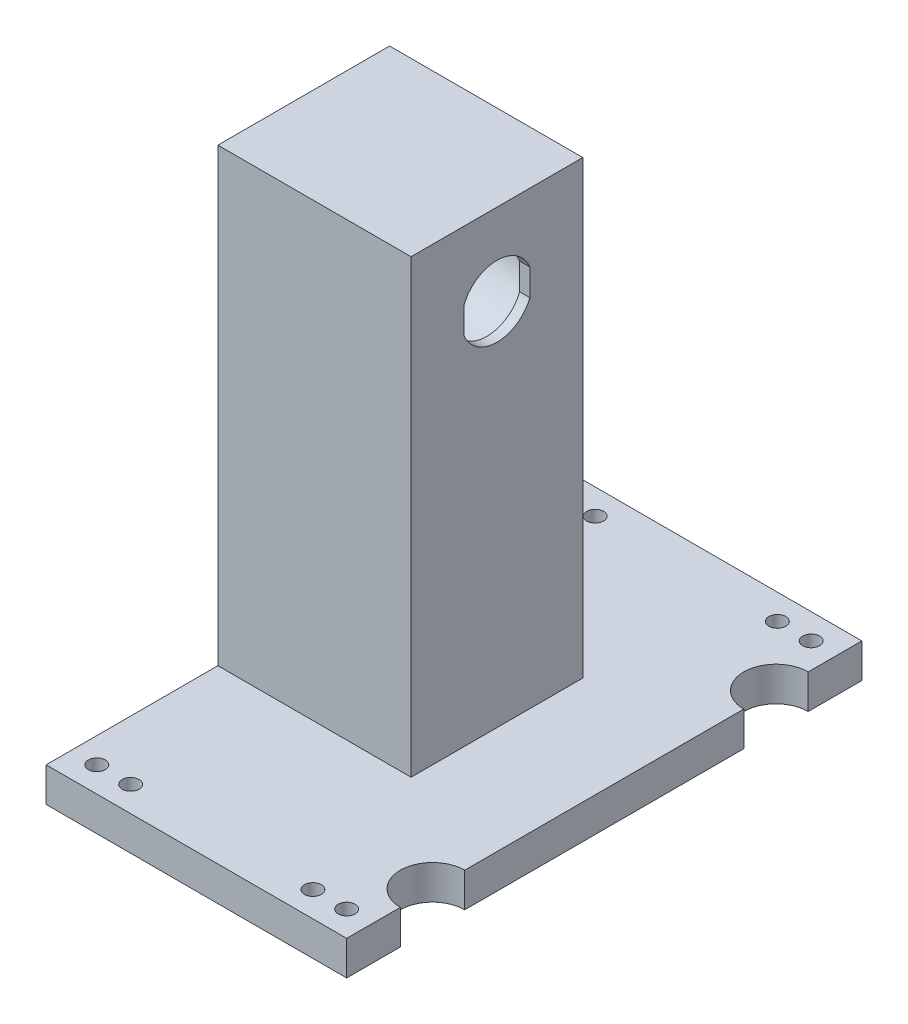
ISO-10303-21;
HEADER;
FILE_DESCRIPTION(('STEP AP214'),'2;1');
FILE_NAME('part.step','',(''),(''),'','','');
FILE_SCHEMA(('AUTOMOTIVE_DESIGN { 1 0 10303 214 1 1 1 1 }'));
ENDSEC;
DATA;
#1=APPLICATION_CONTEXT('core data for automotive mechanical design processes');
#2=APPLICATION_PROTOCOL_DEFINITION('international standard','automotive_design',2000,#1);
#3=PRODUCT_CONTEXT('',#1,'mechanical');
#4=PRODUCT('Part','Part','',(#3));
#5=PRODUCT_RELATED_PRODUCT_CATEGORY('part','',(#4));
#6=PRODUCT_DEFINITION_FORMATION('','',#4);
#7=PRODUCT_DEFINITION_CONTEXT('part definition',#1,'design');
#8=PRODUCT_DEFINITION('design','',#6,#7);
#9=PRODUCT_DEFINITION_SHAPE('','',#8);
#10=(LENGTH_UNIT() NAMED_UNIT(*) SI_UNIT(.MILLI.,.METRE.));
#11=(NAMED_UNIT(*) PLANE_ANGLE_UNIT() SI_UNIT($,.RADIAN.));
#12=(NAMED_UNIT(*) SI_UNIT($,.STERADIAN.) SOLID_ANGLE_UNIT());
#13=UNCERTAINTY_MEASURE_WITH_UNIT(LENGTH_MEASURE(1.E-05),#10,'distance_accuracy_value','');
#14=(GEOMETRIC_REPRESENTATION_CONTEXT(3) GLOBAL_UNCERTAINTY_ASSIGNED_CONTEXT((#13)) GLOBAL_UNIT_ASSIGNED_CONTEXT((#10,
#11,#12)) REPRESENTATION_CONTEXT('',''));
#15=CARTESIAN_POINT('',(0.,0.,0.));
#16=DIRECTION('',(0.,0.,1.));
#17=DIRECTION('',(1.,0.,0.));
#18=AXIS2_PLACEMENT_3D('',#15,#16,#17);
#19=CARTESIAN_POINT('',(53.34,10.16,-56.5855555555556));
#20=DIRECTION('',(-1.,0.,0.));
#21=DIRECTION('',(0.,0.,1.));
#22=AXIS2_PLACEMENT_3D('',#19,#20,#21);
#23=PLANE('',#22);
#24=DIRECTION('',(0.,0.,-1.));
#25=VECTOR('',#24,1.);
#26=CARTESIAN_POINT('',(53.34,0.,-56.5855555555556));
#27=LINE('',#26,#25);
#28=CARTESIAN_POINT('',(53.34,0.,95.8144444444444));
#29=VERTEX_POINT('',#28);
#30=CARTESIAN_POINT('',(53.34,0.,79.9394444444444));
#31=VERTEX_POINT('',#30);
#32=EDGE_CURVE('E183',#29,#31,#27,.T.);
#33=ORIENTED_EDGE('',*,*,#32,.T.);
#34=DIRECTION('',(0.,1.,0.));
#35=VECTOR('',#34,1.);
#36=CARTESIAN_POINT('',(53.34,-2.54,79.9394444444444));
#37=LINE('',#36,#35);
#38=CARTESIAN_POINT('',(53.34,10.16,79.9394444444444));
#39=VERTEX_POINT('',#38);
#40=EDGE_CURVE('E56',#31,#39,#37,.T.);
#41=ORIENTED_EDGE('',*,*,#40,.T.);
#42=DIRECTION('',(0.,0.,-1.));
#43=VECTOR('',#42,1.);
#44=CARTESIAN_POINT('',(53.34,10.16,-56.5855555555556));
#45=LINE('',#44,#43);
#46=CARTESIAN_POINT('',(53.34,10.16,95.8144444444444));
#47=VERTEX_POINT('',#46);
#48=EDGE_CURVE('E166',#47,#39,#45,.T.);
#49=ORIENTED_EDGE('',*,*,#48,.F.);
#50=DIRECTION('',(0.,-1.,0.));
#51=VECTOR('',#50,1.);
#52=CARTESIAN_POINT('',(53.34,10.16,95.8144444444444));
#53=LINE('',#52,#51);
#54=EDGE_CURVE('E194',#47,#29,#53,.T.);
#55=ORIENTED_EDGE('',*,*,#54,.T.);
#56=EDGE_LOOP('',(#33,#41,#49,#55));
#57=FACE_BOUND('',#56,.T.);
#58=ADVANCED_FACE('F33',(#57),#23,.F.);
#59=CARTESIAN_POINT('',(53.34,10.16,60.8894444444444));
#60=VERTEX_POINT('',#59);
#61=CARTESIAN_POINT('',(53.34,10.16,-21.6605555555556));
#62=VERTEX_POINT('',#61);
#63=EDGE_CURVE('E157',#60,#62,#45,.T.);
#64=ORIENTED_EDGE('',*,*,#63,.F.);
#65=DIRECTION('',(0.,1.,0.));
#66=VECTOR('',#65,1.);
#67=CARTESIAN_POINT('',(53.34,-2.54,60.8894444444444));
#68=LINE('',#67,#66);
#69=CARTESIAN_POINT('',(53.34,0.,60.8894444444444));
#70=VERTEX_POINT('',#69);
#71=EDGE_CURVE('E160',#60,#70,#68,.F.);
#72=ORIENTED_EDGE('',*,*,#71,.T.);
#73=CARTESIAN_POINT('',(53.34,0.,-21.6605555555556));
#74=VERTEX_POINT('',#73);
#75=EDGE_CURVE('E159',#70,#74,#27,.T.);
#76=ORIENTED_EDGE('',*,*,#75,.T.);
#77=DIRECTION('',(0.,1.,0.));
#78=VECTOR('',#77,1.);
#79=CARTESIAN_POINT('',(53.34,-2.54,-21.6605555555556));
#80=LINE('',#79,#78);
#81=EDGE_CURVE('E48',#74,#62,#80,.T.);
#82=ORIENTED_EDGE('',*,*,#81,.T.);
#83=EDGE_LOOP('',(#64,#72,#76,#82));
#84=FACE_BOUND('',#83,.T.);
#85=ADVANCED_FACE('F155',(#84),#23,.F.);
#86=CARTESIAN_POINT('',(-35.56,119.38,19.6144444444444));
#87=DIRECTION('',(1.,0.,0.));
#88=DIRECTION('',(0.,0.,-1.));
#89=AXIS2_PLACEMENT_3D('',#86,#87,#88);
#90=CYLINDRICAL_SURFACE('',#89,10.5);
#91=CARTESIAN_POINT('',(21.59,119.38,19.6144444444444));
#92=DIRECTION('',(1.,0.,0.));
#93=DIRECTION('',(0.,0.,-1.));
#94=AXIS2_PLACEMENT_3D('',#91,#92,#93);
#95=CIRCLE('',#94,10.5);
#96=CARTESIAN_POINT('',(21.59,115.443,29.3484072037732));
#97=VERTEX_POINT('',#96);
#98=CARTESIAN_POINT('',(21.59,115.443,9.88048168511562));
#99=VERTEX_POINT('',#98);
#100=EDGE_CURVE('E250',#97,#99,#95,.T.);
#101=ORIENTED_EDGE('',*,*,#100,.T.);
#102=DIRECTION('',(1.,0.,0.));
#103=VECTOR('',#102,1.);
#104=CARTESIAN_POINT('',(10.6788250522381,115.443,9.88048168511562));
#105=LINE('',#104,#103);
#106=CARTESIAN_POINT('',(18.59,115.443,9.88048168511562));
#107=VERTEX_POINT('',#106);
#108=EDGE_CURVE('E226',#107,#99,#105,.T.);
#109=ORIENTED_EDGE('',*,*,#108,.F.);
#110=CARTESIAN_POINT('',(18.59,119.38,19.6144444444444));
#111=DIRECTION('',(-1.,0.,0.));
#112=DIRECTION('',(0.,0.,1.));
#113=AXIS2_PLACEMENT_3D('',#110,#111,#112);
#114=CIRCLE('',#113,10.5);
#115=CARTESIAN_POINT('',(18.59,115.443,29.3484072037732));
#116=VERTEX_POINT('',#115);
#117=EDGE_CURVE('E200',#116,#107,#114,.F.);
#118=ORIENTED_EDGE('',*,*,#117,.F.);
#119=DIRECTION('',(1.,0.,0.));
#120=VECTOR('',#119,1.);
#121=CARTESIAN_POINT('',(10.6788250522381,115.443,29.3484072037732));
#122=LINE('',#121,#120);
#123=EDGE_CURVE('E240',#116,#97,#122,.T.);
#124=ORIENTED_EDGE('',*,*,#123,.T.);
#125=EDGE_LOOP('',(#101,#109,#118,#124));
#126=FACE_BOUND('',#125,.T.);
#127=ADVANCED_FACE('F349',(#126),#90,.F.);
#128=CARTESIAN_POINT('',(18.59,119.38,19.6144444444444));
#129=DIRECTION('',(-1.,0.,0.));
#130=DIRECTION('',(0.,0.,1.));
#131=AXIS2_PLACEMENT_3D('',#128,#129,#130);
#132=CYLINDRICAL_SURFACE('',#131,16.5);
#133=CARTESIAN_POINT('',(18.59,119.38,19.6144444444444));
#134=DIRECTION('',(-1.,0.,0.));
#135=DIRECTION('',(0.,0.,1.));
#136=AXIS2_PLACEMENT_3D('',#133,#134,#135);
#137=CIRCLE('',#136,16.5);
#138=CARTESIAN_POINT('',(18.59,119.38,36.1144444444444));
#139=VERTEX_POINT('',#138);
#140=EDGE_CURVE('E207',#139,#139,#137,.T.);
#141=ORIENTED_EDGE('',*,*,#140,.F.);
#142=EDGE_LOOP('',(#141));
#143=FACE_BOUND('',#142,.T.);
#144=CARTESIAN_POINT('',(-19.05,119.38,19.6144444444444));
#145=DIRECTION('',(-1.,0.,0.));
#146=DIRECTION('',(0.,0.,1.));
#147=AXIS2_PLACEMENT_3D('',#144,#145,#146);
#148=CIRCLE('',#147,16.5);
#149=CARTESIAN_POINT('',(-19.05,119.38,36.1144444444444));
#150=VERTEX_POINT('',#149);
#151=EDGE_CURVE('E205',#150,#150,#148,.F.);
#152=ORIENTED_EDGE('',*,*,#151,.F.);
#153=EDGE_LOOP('',(#152));
#154=FACE_BOUND('',#153,.T.);
#155=ADVANCED_FACE('F366',(#143,#154),#132,.F.);
#156=CARTESIAN_POINT('',(18.59,123.317,9.88048168511561));
#157=VERTEX_POINT('',#156);
#158=CARTESIAN_POINT('',(18.59,123.317,29.3484072037732));
#159=VERTEX_POINT('',#158);
#160=EDGE_CURVE('E204',#157,#159,#114,.F.);
#161=ORIENTED_EDGE('',*,*,#160,.F.);
#162=DIRECTION('',(1.,0.,0.));
#163=VECTOR('',#162,1.);
#164=CARTESIAN_POINT('',(10.6788250522381,123.317,9.88048168511562));
#165=LINE('',#164,#163);
#166=CARTESIAN_POINT('',(21.59,123.317,9.88048168511562));
#167=VERTEX_POINT('',#166);
#168=EDGE_CURVE('E228',#157,#167,#165,.T.);
#169=ORIENTED_EDGE('',*,*,#168,.T.);
#170=CARTESIAN_POINT('',(21.59,123.317,29.3484072037732));
#171=VERTEX_POINT('',#170);
#172=EDGE_CURVE('E203',#167,#171,#95,.T.);
#173=ORIENTED_EDGE('',*,*,#172,.T.);
#174=DIRECTION('',(1.,0.,0.));
#175=VECTOR('',#174,1.);
#176=CARTESIAN_POINT('',(10.6788250522381,123.317,29.3484072037732));
#177=LINE('',#176,#175);
#178=EDGE_CURVE('E237',#159,#171,#177,.T.);
#179=ORIENTED_EDGE('',*,*,#178,.F.);
#180=EDGE_LOOP('',(#161,#169,#173,#179));
#181=FACE_BOUND('',#180,.T.);
#182=ADVANCED_FACE('F361',(#181),#90,.F.);
#183=CARTESIAN_POINT('',(-35.56,10.16,-56.5855555555556));
#184=DIRECTION('',(1.,0.,0.));
#185=DIRECTION('',(0.,0.,-1.));
#186=AXIS2_PLACEMENT_3D('',#183,#184,#185);
#187=PLANE('',#186);
#188=CARTESIAN_POINT('',(-35.56,119.38,19.6144444444444));
#189=DIRECTION('',(-1.,0.,0.));
#190=DIRECTION('',(0.,0.,1.));
#191=AXIS2_PLACEMENT_3D('',#188,#189,#190);
#192=CIRCLE('',#191,19.5);
#193=CARTESIAN_POINT('',(-35.56,119.38,39.1144444444444));
#194=VERTEX_POINT('',#193);
#195=EDGE_CURVE('E243',#194,#194,#192,.T.);
#196=ORIENTED_EDGE('',*,*,#195,.F.);
#197=EDGE_LOOP('',(#196));
#198=FACE_BOUND('',#197,.T.);
#199=DIRECTION('',(0.,0.,1.));
#200=VECTOR('',#199,1.);
#201=CARTESIAN_POINT('',(-35.56,0.,-56.5855555555556));
#202=LINE('',#201,#200);
#203=CARTESIAN_POINT('',(-35.56,0.,-56.5855555555556));
#204=VERTEX_POINT('',#203);
#205=CARTESIAN_POINT('',(-35.56,0.,95.8144444444444));
#206=VERTEX_POINT('',#205);
#207=EDGE_CURVE('E176',#204,#206,#202,.T.);
#208=ORIENTED_EDGE('',*,*,#207,.T.);
#209=DIRECTION('',(0.,-1.,0.));
#210=VECTOR('',#209,1.);
#211=CARTESIAN_POINT('',(-35.56,10.16,95.8144444444444));
#212=LINE('',#211,#210);
#213=CARTESIAN_POINT('',(-35.56,10.16,95.8144444444444));
#214=VERTEX_POINT('',#213);
#215=EDGE_CURVE('E197',#214,#206,#212,.T.);
#216=ORIENTED_EDGE('',*,*,#215,.F.);
#217=DIRECTION('',(0.,0.,1.));
#218=VECTOR('',#217,1.);
#219=CARTESIAN_POINT('',(-35.56,10.16,-56.5855555555556));
#220=LINE('',#219,#218);
#221=CARTESIAN_POINT('',(-35.56,10.16,45.0144444444444));
#222=VERTEX_POINT('',#221);
#223=EDGE_CURVE('E188',#222,#214,#220,.T.);
#224=ORIENTED_EDGE('',*,*,#223,.F.);
#225=DIRECTION('',(0.,-1.,0.));
#226=VECTOR('',#225,1.);
#227=CARTESIAN_POINT('',(-35.56,143.51,45.0144444444444));
#228=LINE('',#227,#226);
#229=CARTESIAN_POINT('',(-35.56,143.51,45.0144444444444));
#230=VERTEX_POINT('',#229);
#231=EDGE_CURVE('E180',#230,#222,#228,.T.);
#232=ORIENTED_EDGE('',*,*,#231,.F.);
#233=DIRECTION('',(0.,0.,1.));
#234=VECTOR('',#233,1.);
#235=CARTESIAN_POINT('',(-35.56,143.51,45.0144444444444));
#236=LINE('',#235,#234);
#237=CARTESIAN_POINT('',(-35.56,143.51,-5.78555555555559));
#238=VERTEX_POINT('',#237);
#239=EDGE_CURVE('E302',#238,#230,#236,.T.);
#240=ORIENTED_EDGE('',*,*,#239,.F.);
#241=DIRECTION('',(0.,-1.,0.));
#242=VECTOR('',#241,1.);
#243=CARTESIAN_POINT('',(-35.56,143.51,-5.78555555555559));
#244=LINE('',#243,#242);
#245=CARTESIAN_POINT('',(-35.56,10.16,-5.7855555555556));
#246=VERTEX_POINT('',#245);
#247=EDGE_CURVE('E312',#238,#246,#244,.T.);
#248=ORIENTED_EDGE('',*,*,#247,.T.);
#249=CARTESIAN_POINT('',(-35.56,10.16,-56.5855555555556));
#250=VERTEX_POINT('',#249);
#251=EDGE_CURVE('E329',#250,#246,#220,.T.);
#252=ORIENTED_EDGE('',*,*,#251,.F.);
#253=DIRECTION('',(0.,-1.,0.));
#254=VECTOR('',#253,1.);
#255=CARTESIAN_POINT('',(-35.56,10.16,-56.5855555555556));
#256=LINE('',#255,#254);
#257=EDGE_CURVE('E175',#250,#204,#256,.T.);
#258=ORIENTED_EDGE('',*,*,#257,.T.);
#259=EDGE_LOOP('',(#208,#216,#224,#232,#240,#248,#252,#258));
#260=FACE_BOUND('',#259,.T.);
#261=ADVANCED_FACE('F35',(#198,#260),#187,.F.);
#262=CARTESIAN_POINT('',(-35.56,10.16,95.8144444444444));
#263=DIRECTION('',(0.,0.,-1.));
#264=DIRECTION('',(-1.,0.,0.));
#265=AXIS2_PLACEMENT_3D('',#262,#263,#264);
#266=PLANE('',#265);
#267=DIRECTION('',(1.,0.,0.));
#268=VECTOR('',#267,1.);
#269=CARTESIAN_POINT('',(-35.56,0.,95.8144444444444));
#270=LINE('',#269,#268);
#271=EDGE_CURVE('E179',#206,#29,#270,.T.);
#272=ORIENTED_EDGE('',*,*,#271,.T.);
#273=ORIENTED_EDGE('',*,*,#54,.F.);
#274=DIRECTION('',(1.,0.,0.));
#275=VECTOR('',#274,1.);
#276=CARTESIAN_POINT('',(-35.56,10.16,95.8144444444444));
#277=LINE('',#276,#275);
#278=EDGE_CURVE('E170',#214,#47,#277,.T.);
#279=ORIENTED_EDGE('',*,*,#278,.F.);
#280=ORIENTED_EDGE('',*,*,#215,.T.);
#281=EDGE_LOOP('',(#272,#273,#279,#280));
#282=FACE_BOUND('',#281,.T.);
#283=ADVANCED_FACE('F338',(#282),#266,.F.);
#284=CARTESIAN_POINT('',(53.34,10.16,-40.7105555555556));
#285=VERTEX_POINT('',#284);
#286=CARTESIAN_POINT('',(53.34,10.16,-56.5855555555556));
#287=VERTEX_POINT('',#286);
#288=EDGE_CURVE('E167',#285,#287,#45,.T.);
#289=ORIENTED_EDGE('',*,*,#288,.F.);
#290=DIRECTION('',(0.,1.,0.));
#291=VECTOR('',#290,1.);
#292=CARTESIAN_POINT('',(53.34,-2.54,-40.7105555555556));
#293=LINE('',#292,#291);
#294=CARTESIAN_POINT('',(53.34,0.,-40.7105555555556));
#295=VERTEX_POINT('',#294);
#296=EDGE_CURVE('E146',#285,#295,#293,.F.);
#297=ORIENTED_EDGE('',*,*,#296,.T.);
#298=CARTESIAN_POINT('',(53.34,0.,-56.5855555555556));
#299=VERTEX_POINT('',#298);
#300=EDGE_CURVE('E182',#295,#299,#27,.T.);
#301=ORIENTED_EDGE('',*,*,#300,.T.);
#302=DIRECTION('',(0.,-1.,0.));
#303=VECTOR('',#302,1.);
#304=CARTESIAN_POINT('',(53.34,10.16,-56.5855555555556));
#305=LINE('',#304,#303);
#306=EDGE_CURVE('E191',#287,#299,#305,.T.);
#307=ORIENTED_EDGE('',*,*,#306,.F.);
#308=EDGE_LOOP('',(#289,#297,#301,#307));
#309=FACE_BOUND('',#308,.T.);
#310=ADVANCED_FACE('F214',(#309),#23,.F.);
#311=CARTESIAN_POINT('',(-35.56,10.16,-56.5855555555556));
#312=DIRECTION('',(0.,0.,1.));
#313=DIRECTION('',(1.,0.,0.));
#314=AXIS2_PLACEMENT_3D('',#311,#312,#313);
#315=PLANE('',#314);
#316=DIRECTION('',(-1.,0.,0.));
#317=VECTOR('',#316,1.);
#318=CARTESIAN_POINT('',(-35.56,0.,-56.5855555555556));
#319=LINE('',#318,#317);
#320=EDGE_CURVE('E186',#299,#204,#319,.T.);
#321=ORIENTED_EDGE('',*,*,#320,.T.);
#322=ORIENTED_EDGE('',*,*,#257,.F.);
#323=DIRECTION('',(-1.,0.,0.));
#324=VECTOR('',#323,1.);
#325=CARTESIAN_POINT('',(-35.56,10.16,-56.5855555555556));
#326=LINE('',#325,#324);
#327=EDGE_CURVE('E169',#287,#250,#326,.T.);
#328=ORIENTED_EDGE('',*,*,#327,.F.);
#329=ORIENTED_EDGE('',*,*,#306,.T.);
#330=EDGE_LOOP('',(#321,#322,#328,#329));
#331=FACE_BOUND('',#330,.T.);
#332=ADVANCED_FACE('F352',(#331),#315,.F.);
#333=CARTESIAN_POINT('',(0.,10.16,0.));
#334=DIRECTION('',(0.,1.,0.));
#335=DIRECTION('',(0.,0.,1.));
#336=AXIS2_PLACEMENT_3D('',#333,#334,#335);
#337=PLANE('',#336);
#338=CARTESIAN_POINT('',(53.34,10.16,70.4144444444444));
#339=DIRECTION('',(0.,1.,0.));
#340=DIRECTION('',(0.,0.,1.));
#341=AXIS2_PLACEMENT_3D('',#338,#339,#340);
#342=CIRCLE('',#341,9.525);
#343=EDGE_CURVE('E150',#60,#39,#342,.T.);
#344=ORIENTED_EDGE('',*,*,#343,.F.);
#345=ORIENTED_EDGE('',*,*,#63,.T.);
#346=CARTESIAN_POINT('',(53.34,10.16,-31.1855555555556));
#347=DIRECTION('',(0.,1.,0.));
#348=DIRECTION('',(0.,0.,1.));
#349=AXIS2_PLACEMENT_3D('',#346,#347,#348);
#350=CIRCLE('',#349,9.525);
#351=EDGE_CURVE('E143',#285,#62,#350,.T.);
#352=ORIENTED_EDGE('',*,*,#351,.F.);
#353=ORIENTED_EDGE('',*,*,#288,.T.);
#354=ORIENTED_EDGE('',*,*,#327,.T.);
#355=ORIENTED_EDGE('',*,*,#251,.T.);
#356=DIRECTION('',(-1.,0.,0.));
#357=VECTOR('',#356,1.);
#358=CARTESIAN_POINT('',(-35.56,10.16,-5.78555555555559));
#359=LINE('',#358,#357);
#360=CARTESIAN_POINT('',(21.59,10.16,-5.78555555555559));
#361=VERTEX_POINT('',#360);
#362=EDGE_CURVE('E306',#361,#246,#359,.T.);
#363=ORIENTED_EDGE('',*,*,#362,.F.);
#364=DIRECTION('',(0.,0.,-1.));
#365=VECTOR('',#364,1.);
#366=CARTESIAN_POINT('',(21.59,10.16,45.0144444444444));
#367=LINE('',#366,#365);
#368=CARTESIAN_POINT('',(21.59,10.16,45.0144444444444));
#369=VERTEX_POINT('',#368);
#370=EDGE_CURVE('E315',#369,#361,#367,.T.);
#371=ORIENTED_EDGE('',*,*,#370,.F.);
#372=DIRECTION('',(1.,0.,0.));
#373=VECTOR('',#372,1.);
#374=CARTESIAN_POINT('',(-35.56,10.16,45.0144444444444));
#375=LINE('',#374,#373);
#376=EDGE_CURVE('E299',#222,#369,#375,.T.);
#377=ORIENTED_EDGE('',*,*,#376,.F.);
#378=ORIENTED_EDGE('',*,*,#223,.T.);
#379=ORIENTED_EDGE('',*,*,#278,.T.);
#380=ORIENTED_EDGE('',*,*,#48,.T.);
#381=EDGE_LOOP('',(#344,#345,#352,#353,#354,#355,#363,#371,#377,#378,#379,#380));
#382=FACE_BOUND('',#381,.T.);
#383=CARTESIAN_POINT('',(-28.06,10.16,-49.0855555555556));
#384=DIRECTION('',(0.,1.,0.));
#385=DIRECTION('',(0.,0.,1.));
#386=AXIS2_PLACEMENT_3D('',#383,#384,#385);
#387=CIRCLE('',#386,2.5);
#388=CARTESIAN_POINT('',(-28.06,10.16,-46.5855555555556));
#389=VERTEX_POINT('',#388);
#390=EDGE_CURVE('E257',#389,#389,#387,.T.);
#391=ORIENTED_EDGE('',*,*,#390,.F.);
#392=EDGE_LOOP('',(#391));
#393=FACE_BOUND('',#392,.T.);
#394=CARTESIAN_POINT('',(-18.06,10.16,88.3144444444444));
#395=DIRECTION('',(0.,1.,0.));
#396=DIRECTION('',(0.,0.,1.));
#397=AXIS2_PLACEMENT_3D('',#394,#395,#396);
#398=CIRCLE('',#397,2.5);
#399=CARTESIAN_POINT('',(-18.06,10.16,90.8144444444444));
#400=VERTEX_POINT('',#399);
#401=EDGE_CURVE('E276',#400,#400,#398,.T.);
#402=ORIENTED_EDGE('',*,*,#401,.F.);
#403=EDGE_LOOP('',(#402));
#404=FACE_BOUND('',#403,.T.);
#405=CARTESIAN_POINT('',(-28.06,10.16,88.3144444444444));
#406=DIRECTION('',(0.,1.,0.));
#407=DIRECTION('',(0.,0.,1.));
#408=AXIS2_PLACEMENT_3D('',#405,#406,#407);
#409=CIRCLE('',#408,2.5);
#410=CARTESIAN_POINT('',(-28.06,10.16,90.8144444444444));
#411=VERTEX_POINT('',#410);
#412=EDGE_CURVE('E275',#411,#411,#409,.T.);
#413=ORIENTED_EDGE('',*,*,#412,.F.);
#414=EDGE_LOOP('',(#413));
#415=FACE_BOUND('',#414,.T.);
#416=CARTESIAN_POINT('',(45.84,10.16,88.3144444444444));
#417=DIRECTION('',(0.,1.,0.));
#418=DIRECTION('',(0.,0.,1.));
#419=AXIS2_PLACEMENT_3D('',#416,#417,#418);
#420=CIRCLE('',#419,2.5);
#421=CARTESIAN_POINT('',(45.84,10.16,90.8144444444444));
#422=VERTEX_POINT('',#421);
#423=EDGE_CURVE('E288',#422,#422,#420,.T.);
#424=ORIENTED_EDGE('',*,*,#423,.F.);
#425=EDGE_LOOP('',(#424));
#426=FACE_BOUND('',#425,.T.);
#427=CARTESIAN_POINT('',(-18.06,10.16,-49.0855555555556));
#428=DIRECTION('',(0.,1.,0.));
#429=DIRECTION('',(0.,0.,1.));
#430=AXIS2_PLACEMENT_3D('',#427,#428,#429);
#431=CIRCLE('',#430,2.5);
#432=CARTESIAN_POINT('',(-18.06,10.16,-46.5855555555556));
#433=VERTEX_POINT('',#432);
#434=EDGE_CURVE('E258',#433,#433,#431,.T.);
#435=ORIENTED_EDGE('',*,*,#434,.F.);
#436=EDGE_LOOP('',(#435));
#437=FACE_BOUND('',#436,.T.);
#438=CARTESIAN_POINT('',(35.84,10.16,-49.0855555555556));
#439=DIRECTION('',(0.,1.,0.));
#440=DIRECTION('',(0.,0.,1.));
#441=AXIS2_PLACEMENT_3D('',#438,#439,#440);
#442=CIRCLE('',#441,2.5);
#443=CARTESIAN_POINT('',(35.84,10.16,-46.5855555555556));
#444=VERTEX_POINT('',#443);
#445=EDGE_CURVE('E264',#444,#444,#442,.T.);
#446=ORIENTED_EDGE('',*,*,#445,.F.);
#447=EDGE_LOOP('',(#446));
#448=FACE_BOUND('',#447,.T.);
#449=CARTESIAN_POINT('',(45.84,10.16,-49.0855555555556));
#450=DIRECTION('',(0.,1.,0.));
#451=DIRECTION('',(0.,0.,1.));
#452=AXIS2_PLACEMENT_3D('',#449,#450,#451);
#453=CIRCLE('',#452,2.5);
#454=CARTESIAN_POINT('',(45.84,10.16,-46.5855555555556));
#455=VERTEX_POINT('',#454);
#456=EDGE_CURVE('E253',#455,#455,#453,.T.);
#457=ORIENTED_EDGE('',*,*,#456,.F.);
#458=EDGE_LOOP('',(#457));
#459=FACE_BOUND('',#458,.T.);
#460=CARTESIAN_POINT('',(35.84,10.16,88.3144444444444));
#461=DIRECTION('',(0.,1.,0.));
#462=DIRECTION('',(0.,0.,1.));
#463=AXIS2_PLACEMENT_3D('',#460,#461,#462);
#464=CIRCLE('',#463,2.5);
#465=CARTESIAN_POINT('',(35.84,10.16,90.8144444444444));
#466=VERTEX_POINT('',#465);
#467=EDGE_CURVE('E287',#466,#466,#464,.T.);
#468=ORIENTED_EDGE('',*,*,#467,.F.);
#469=EDGE_LOOP('',(#468));
#470=FACE_BOUND('',#469,.T.);
#471=ADVANCED_FACE('F163',(#382,#393,#404,#415,#426,#437,#448,#459,#470),#337,.T.);
#472=CARTESIAN_POINT('',(0.,0.,0.));
#473=DIRECTION('',(0.,1.,0.));
#474=DIRECTION('',(0.,0.,1.));
#475=AXIS2_PLACEMENT_3D('',#472,#473,#474);
#476=PLANE('',#475);
#477=CARTESIAN_POINT('',(-28.06,0.,-49.0855555555556));
#478=DIRECTION('',(0.,1.,0.));
#479=DIRECTION('',(0.,0.,1.));
#480=AXIS2_PLACEMENT_3D('',#477,#478,#479);
#481=CIRCLE('',#480,2.5);
#482=CARTESIAN_POINT('',(-28.06,0.,-46.5855555555556));
#483=VERTEX_POINT('',#482);
#484=EDGE_CURVE('E279',#483,#483,#481,.T.);
#485=ORIENTED_EDGE('',*,*,#484,.T.);
#486=EDGE_LOOP('',(#485));
#487=FACE_BOUND('',#486,.T.);
#488=CARTESIAN_POINT('',(-18.06,0.,88.3144444444444));
#489=DIRECTION('',(0.,1.,0.));
#490=DIRECTION('',(0.,0.,1.));
#491=AXIS2_PLACEMENT_3D('',#488,#489,#490);
#492=CIRCLE('',#491,2.5);
#493=CARTESIAN_POINT('',(-18.06,0.,90.8144444444444));
#494=VERTEX_POINT('',#493);
#495=EDGE_CURVE('E272',#494,#494,#492,.T.);
#496=ORIENTED_EDGE('',*,*,#495,.T.);
#497=EDGE_LOOP('',(#496));
#498=FACE_BOUND('',#497,.T.);
#499=CARTESIAN_POINT('',(-28.06,0.,88.3144444444444));
#500=DIRECTION('',(0.,1.,0.));
#501=DIRECTION('',(0.,0.,1.));
#502=AXIS2_PLACEMENT_3D('',#499,#500,#501);
#503=CIRCLE('',#502,2.5);
#504=CARTESIAN_POINT('',(-28.06,0.,90.8144444444444));
#505=VERTEX_POINT('',#504);
#506=EDGE_CURVE('E291',#505,#505,#503,.T.);
#507=ORIENTED_EDGE('',*,*,#506,.T.);
#508=EDGE_LOOP('',(#507));
#509=FACE_BOUND('',#508,.T.);
#510=CARTESIAN_POINT('',(45.84,0.,88.3144444444444));
#511=DIRECTION('',(0.,1.,0.));
#512=DIRECTION('',(0.,0.,1.));
#513=AXIS2_PLACEMENT_3D('',#510,#511,#512);
#514=CIRCLE('',#513,2.5);
#515=CARTESIAN_POINT('',(45.84,0.,90.8144444444444));
#516=VERTEX_POINT('',#515);
#517=EDGE_CURVE('E284',#516,#516,#514,.T.);
#518=ORIENTED_EDGE('',*,*,#517,.T.);
#519=EDGE_LOOP('',(#518));
#520=FACE_BOUND('',#519,.T.);
#521=CARTESIAN_POINT('',(-18.06,0.,-49.0855555555556));
#522=DIRECTION('',(0.,1.,0.));
#523=DIRECTION('',(0.,0.,1.));
#524=AXIS2_PLACEMENT_3D('',#521,#522,#523);
#525=CIRCLE('',#524,2.5);
#526=CARTESIAN_POINT('',(-18.06,0.,-46.5855555555556));
#527=VERTEX_POINT('',#526);
#528=EDGE_CURVE('E254',#527,#527,#525,.T.);
#529=ORIENTED_EDGE('',*,*,#528,.T.);
#530=EDGE_LOOP('',(#529));
#531=FACE_BOUND('',#530,.T.);
#532=CARTESIAN_POINT('',(35.84,0.,-49.0855555555556));
#533=DIRECTION('',(0.,1.,0.));
#534=DIRECTION('',(0.,0.,1.));
#535=AXIS2_PLACEMENT_3D('',#532,#533,#534);
#536=CIRCLE('',#535,2.5);
#537=CARTESIAN_POINT('',(35.84,0.,-46.5855555555556));
#538=VERTEX_POINT('',#537);
#539=EDGE_CURVE('E261',#538,#538,#536,.T.);
#540=ORIENTED_EDGE('',*,*,#539,.T.);
#541=EDGE_LOOP('',(#540));
#542=FACE_BOUND('',#541,.T.);
#543=CARTESIAN_POINT('',(45.84,0.,-49.0855555555556));
#544=DIRECTION('',(0.,1.,0.));
#545=DIRECTION('',(0.,0.,1.));
#546=AXIS2_PLACEMENT_3D('',#543,#544,#545);
#547=CIRCLE('',#546,2.5);
#548=CARTESIAN_POINT('',(45.84,0.,-46.5855555555556));
#549=VERTEX_POINT('',#548);
#550=EDGE_CURVE('E267',#549,#549,#547,.T.);
#551=ORIENTED_EDGE('',*,*,#550,.T.);
#552=EDGE_LOOP('',(#551));
#553=FACE_BOUND('',#552,.T.);
#554=CARTESIAN_POINT('',(35.84,0.,88.3144444444444));
#555=DIRECTION('',(0.,1.,0.));
#556=DIRECTION('',(0.,0.,1.));
#557=AXIS2_PLACEMENT_3D('',#554,#555,#556);
#558=CIRCLE('',#557,2.5);
#559=CARTESIAN_POINT('',(35.84,0.,90.8144444444444));
#560=VERTEX_POINT('',#559);
#561=EDGE_CURVE('E296',#560,#560,#558,.T.);
#562=ORIENTED_EDGE('',*,*,#561,.T.);
#563=EDGE_LOOP('',(#562));
#564=FACE_BOUND('',#563,.T.);
#565=ORIENTED_EDGE('',*,*,#75,.F.);
#566=CARTESIAN_POINT('',(53.34,0.,70.4144444444444));
#567=DIRECTION('',(0.,1.,0.));
#568=DIRECTION('',(0.,0.,1.));
#569=AXIS2_PLACEMENT_3D('',#566,#567,#568);
#570=CIRCLE('',#569,9.525);
#571=EDGE_CURVE('E11',#70,#31,#570,.T.);
#572=ORIENTED_EDGE('',*,*,#571,.T.);
#573=ORIENTED_EDGE('',*,*,#32,.F.);
#574=ORIENTED_EDGE('',*,*,#271,.F.);
#575=ORIENTED_EDGE('',*,*,#207,.F.);
#576=ORIENTED_EDGE('',*,*,#320,.F.);
#577=ORIENTED_EDGE('',*,*,#300,.F.);
#578=CARTESIAN_POINT('',(53.34,0.,-31.1855555555556));
#579=DIRECTION('',(0.,1.,0.));
#580=DIRECTION('',(0.,0.,1.));
#581=AXIS2_PLACEMENT_3D('',#578,#579,#580);
#582=CIRCLE('',#581,9.525);
#583=EDGE_CURVE('E41',#295,#74,#582,.T.);
#584=ORIENTED_EDGE('',*,*,#583,.T.);
#585=EDGE_LOOP('',(#565,#572,#573,#574,#575,#576,#577,#584));
#586=FACE_BOUND('',#585,.T.);
#587=ADVANCED_FACE('F211',(#487,#498,#509,#520,#531,#542,#553,#564,#586),#476,.F.);
#588=CARTESIAN_POINT('',(-35.56,143.51,45.0144444444444));
#589=DIRECTION('',(0.,0.,-1.));
#590=DIRECTION('',(-1.,0.,0.));
#591=AXIS2_PLACEMENT_3D('',#588,#589,#590);
#592=PLANE('',#591);
#593=ORIENTED_EDGE('',*,*,#376,.T.);
#594=DIRECTION('',(0.,-1.,0.));
#595=VECTOR('',#594,1.);
#596=CARTESIAN_POINT('',(21.59,143.51,45.0144444444444));
#597=LINE('',#596,#595);
#598=CARTESIAN_POINT('',(21.59,143.51,45.0144444444444));
#599=VERTEX_POINT('',#598);
#600=EDGE_CURVE('E325',#599,#369,#597,.T.);
#601=ORIENTED_EDGE('',*,*,#600,.F.);
#602=DIRECTION('',(1.,0.,0.));
#603=VECTOR('',#602,1.);
#604=CARTESIAN_POINT('',(-35.56,143.51,45.0144444444444));
#605=LINE('',#604,#603);
#606=EDGE_CURVE('E305',#230,#599,#605,.T.);
#607=ORIENTED_EDGE('',*,*,#606,.F.);
#608=ORIENTED_EDGE('',*,*,#231,.T.);
#609=EDGE_LOOP('',(#593,#601,#607,#608));
#610=FACE_BOUND('',#609,.T.);
#611=ADVANCED_FACE('F438',(#610),#592,.F.);
#612=CARTESIAN_POINT('',(21.59,143.51,45.0144444444444));
#613=DIRECTION('',(-1.,0.,0.));
#614=DIRECTION('',(0.,0.,1.));
#615=AXIS2_PLACEMENT_3D('',#612,#613,#614);
#616=PLANE('',#615);
#617=ORIENTED_EDGE('',*,*,#100,.F.);
#618=DIRECTION('',(0.,1.,0.));
#619=VECTOR('',#618,1.);
#620=CARTESIAN_POINT('',(21.59,123.317,29.3484072037732));
#621=LINE('',#620,#619);
#622=EDGE_CURVE('E231',#97,#171,#621,.T.);
#623=ORIENTED_EDGE('',*,*,#622,.T.);
#624=ORIENTED_EDGE('',*,*,#172,.F.);
#625=DIRECTION('',(0.,-1.,0.));
#626=VECTOR('',#625,1.);
#627=CARTESIAN_POINT('',(21.59,115.443,9.88048168511562));
#628=LINE('',#627,#626);
#629=EDGE_CURVE('E221',#167,#99,#628,.T.);
#630=ORIENTED_EDGE('',*,*,#629,.T.);
#631=EDGE_LOOP('',(#617,#623,#624,#630));
#632=FACE_BOUND('',#631,.T.);
#633=ORIENTED_EDGE('',*,*,#370,.T.);
#634=DIRECTION('',(0.,-1.,0.));
#635=VECTOR('',#634,1.);
#636=CARTESIAN_POINT('',(21.59,143.51,-5.78555555555559));
#637=LINE('',#636,#635);
#638=CARTESIAN_POINT('',(21.59,143.51,-5.78555555555559));
#639=VERTEX_POINT('',#638);
#640=EDGE_CURVE('E322',#639,#361,#637,.T.);
#641=ORIENTED_EDGE('',*,*,#640,.F.);
#642=DIRECTION('',(0.,0.,-1.));
#643=VECTOR('',#642,1.);
#644=CARTESIAN_POINT('',(21.59,143.51,45.0144444444444));
#645=LINE('',#644,#643);
#646=EDGE_CURVE('E308',#599,#639,#645,.T.);
#647=ORIENTED_EDGE('',*,*,#646,.F.);
#648=ORIENTED_EDGE('',*,*,#600,.T.);
#649=EDGE_LOOP('',(#633,#641,#647,#648));
#650=FACE_BOUND('',#649,.T.);
#651=ADVANCED_FACE('F434',(#632,#650),#616,.F.);
#652=CARTESIAN_POINT('',(-35.56,143.51,-5.78555555555559));
#653=DIRECTION('',(0.,0.,1.));
#654=DIRECTION('',(1.,0.,0.));
#655=AXIS2_PLACEMENT_3D('',#652,#653,#654);
#656=PLANE('',#655);
#657=ORIENTED_EDGE('',*,*,#362,.T.);
#658=ORIENTED_EDGE('',*,*,#247,.F.);
#659=DIRECTION('',(-1.,0.,0.));
#660=VECTOR('',#659,1.);
#661=CARTESIAN_POINT('',(-35.56,143.51,-5.78555555555559));
#662=LINE('',#661,#660);
#663=EDGE_CURVE('E310',#639,#238,#662,.T.);
#664=ORIENTED_EDGE('',*,*,#663,.F.);
#665=ORIENTED_EDGE('',*,*,#640,.T.);
#666=EDGE_LOOP('',(#657,#658,#664,#665));
#667=FACE_BOUND('',#666,.T.);
#668=ADVANCED_FACE('F430',(#667),#656,.F.);
#669=CARTESIAN_POINT('',(0.,143.51,0.));
#670=DIRECTION('',(0.,-1.,0.));
#671=DIRECTION('',(0.,0.,-1.));
#672=AXIS2_PLACEMENT_3D('',#669,#670,#671);
#673=PLANE('',#672);
#674=ORIENTED_EDGE('',*,*,#239,.T.);
#675=ORIENTED_EDGE('',*,*,#606,.T.);
#676=ORIENTED_EDGE('',*,*,#646,.T.);
#677=ORIENTED_EDGE('',*,*,#663,.T.);
#678=EDGE_LOOP('',(#674,#675,#676,#677));
#679=FACE_BOUND('',#678,.T.);
#680=ADVANCED_FACE('F426',(#679),#673,.F.);
#681=CARTESIAN_POINT('',(35.84,0.,88.3144444444444));
#682=DIRECTION('',(0.,1.,0.));
#683=DIRECTION('',(0.,0.,1.));
#684=AXIS2_PLACEMENT_3D('',#681,#682,#683);
#685=CYLINDRICAL_SURFACE('',#684,2.5);
#686=ORIENTED_EDGE('',*,*,#561,.F.);
#687=EDGE_LOOP('',(#686));
#688=FACE_BOUND('',#687,.T.);
#689=ORIENTED_EDGE('',*,*,#467,.T.);
#690=EDGE_LOOP('',(#689));
#691=FACE_BOUND('',#690,.T.);
#692=ADVANCED_FACE('F408',(#688,#691),#685,.F.);
#693=CARTESIAN_POINT('',(45.84,0.,-49.0855555555556));
#694=DIRECTION('',(0.,1.,0.));
#695=DIRECTION('',(0.,0.,1.));
#696=AXIS2_PLACEMENT_3D('',#693,#694,#695);
#697=CYLINDRICAL_SURFACE('',#696,2.5);
#698=ORIENTED_EDGE('',*,*,#550,.F.);
#699=EDGE_LOOP('',(#698));
#700=FACE_BOUND('',#699,.T.);
#701=ORIENTED_EDGE('',*,*,#456,.T.);
#702=EDGE_LOOP('',(#701));
#703=FACE_BOUND('',#702,.T.);
#704=ADVANCED_FACE('F404',(#700,#703),#697,.F.);
#705=CARTESIAN_POINT('',(35.84,0.,-49.0855555555556));
#706=DIRECTION('',(0.,1.,0.));
#707=DIRECTION('',(0.,0.,1.));
#708=AXIS2_PLACEMENT_3D('',#705,#706,#707);
#709=CYLINDRICAL_SURFACE('',#708,2.5);
#710=ORIENTED_EDGE('',*,*,#539,.F.);
#711=EDGE_LOOP('',(#710));
#712=FACE_BOUND('',#711,.T.);
#713=ORIENTED_EDGE('',*,*,#445,.T.);
#714=EDGE_LOOP('',(#713));
#715=FACE_BOUND('',#714,.T.);
#716=ADVANCED_FACE('F400',(#712,#715),#709,.F.);
#717=CARTESIAN_POINT('',(-18.06,0.,-49.0855555555556));
#718=DIRECTION('',(0.,1.,0.));
#719=DIRECTION('',(0.,0.,1.));
#720=AXIS2_PLACEMENT_3D('',#717,#718,#719);
#721=CYLINDRICAL_SURFACE('',#720,2.5);
#722=ORIENTED_EDGE('',*,*,#528,.F.);
#723=EDGE_LOOP('',(#722));
#724=FACE_BOUND('',#723,.T.);
#725=ORIENTED_EDGE('',*,*,#434,.T.);
#726=EDGE_LOOP('',(#725));
#727=FACE_BOUND('',#726,.T.);
#728=ADVANCED_FACE('F396',(#724,#727),#721,.F.);
#729=CARTESIAN_POINT('',(45.84,0.,88.3144444444444));
#730=DIRECTION('',(0.,1.,0.));
#731=DIRECTION('',(0.,0.,1.));
#732=AXIS2_PLACEMENT_3D('',#729,#730,#731);
#733=CYLINDRICAL_SURFACE('',#732,2.5);
#734=ORIENTED_EDGE('',*,*,#517,.F.);
#735=EDGE_LOOP('',(#734));
#736=FACE_BOUND('',#735,.T.);
#737=ORIENTED_EDGE('',*,*,#423,.T.);
#738=EDGE_LOOP('',(#737));
#739=FACE_BOUND('',#738,.T.);
#740=ADVANCED_FACE('F399',(#736,#739),#733,.F.);
#741=CARTESIAN_POINT('',(-28.06,0.,88.3144444444444));
#742=DIRECTION('',(0.,1.,0.));
#743=DIRECTION('',(0.,0.,1.));
#744=AXIS2_PLACEMENT_3D('',#741,#742,#743);
#745=CYLINDRICAL_SURFACE('',#744,2.5);
#746=ORIENTED_EDGE('',*,*,#506,.F.);
#747=EDGE_LOOP('',(#746));
#748=FACE_BOUND('',#747,.T.);
#749=ORIENTED_EDGE('',*,*,#412,.T.);
#750=EDGE_LOOP('',(#749));
#751=FACE_BOUND('',#750,.T.);
#752=ADVANCED_FACE('F413',(#748,#751),#745,.F.);
#753=CARTESIAN_POINT('',(-18.06,0.,88.3144444444444));
#754=DIRECTION('',(0.,1.,0.));
#755=DIRECTION('',(0.,0.,1.));
#756=AXIS2_PLACEMENT_3D('',#753,#754,#755);
#757=CYLINDRICAL_SURFACE('',#756,2.5);
#758=ORIENTED_EDGE('',*,*,#495,.F.);
#759=EDGE_LOOP('',(#758));
#760=FACE_BOUND('',#759,.T.);
#761=ORIENTED_EDGE('',*,*,#401,.T.);
#762=EDGE_LOOP('',(#761));
#763=FACE_BOUND('',#762,.T.);
#764=ADVANCED_FACE('F410',(#760,#763),#757,.F.);
#765=CARTESIAN_POINT('',(-28.06,0.,-49.0855555555556));
#766=DIRECTION('',(0.,1.,0.));
#767=DIRECTION('',(0.,0.,1.));
#768=AXIS2_PLACEMENT_3D('',#765,#766,#767);
#769=CYLINDRICAL_SURFACE('',#768,2.5);
#770=ORIENTED_EDGE('',*,*,#484,.F.);
#771=EDGE_LOOP('',(#770));
#772=FACE_BOUND('',#771,.T.);
#773=ORIENTED_EDGE('',*,*,#390,.T.);
#774=EDGE_LOOP('',(#773));
#775=FACE_BOUND('',#774,.T.);
#776=ADVANCED_FACE('F391',(#772,#775),#769,.F.);
#777=CARTESIAN_POINT('',(18.59,119.38,19.6144444444444));
#778=DIRECTION('',(-1.,0.,0.));
#779=DIRECTION('',(0.,0.,1.));
#780=AXIS2_PLACEMENT_3D('',#777,#778,#779);
#781=PLANE('',#780);
#782=ORIENTED_EDGE('',*,*,#140,.T.);
#783=EDGE_LOOP('',(#782));
#784=FACE_BOUND('',#783,.T.);
#785=ORIENTED_EDGE('',*,*,#117,.T.);
#786=DIRECTION('',(0.,-1.,0.));
#787=VECTOR('',#786,1.);
#788=CARTESIAN_POINT('',(18.59,115.443,9.88048168511562));
#789=LINE('',#788,#787);
#790=EDGE_CURVE('E224',#157,#107,#789,.T.);
#791=ORIENTED_EDGE('',*,*,#790,.F.);
#792=ORIENTED_EDGE('',*,*,#160,.T.);
#793=DIRECTION('',(0.,1.,0.));
#794=VECTOR('',#793,1.);
#795=CARTESIAN_POINT('',(18.59,123.317,29.3484072037732));
#796=LINE('',#795,#794);
#797=EDGE_CURVE('E234',#116,#159,#796,.T.);
#798=ORIENTED_EDGE('',*,*,#797,.F.);
#799=EDGE_LOOP('',(#785,#791,#792,#798));
#800=FACE_BOUND('',#799,.T.);
#801=ADVANCED_FACE('F384',(#784,#800),#781,.T.);
#802=CARTESIAN_POINT('',(-19.05,119.38,19.6144444444444));
#803=DIRECTION('',(-1.,0.,0.));
#804=DIRECTION('',(0.,0.,1.));
#805=AXIS2_PLACEMENT_3D('',#802,#803,#804);
#806=PLANE('',#805);
#807=CARTESIAN_POINT('',(-19.05,119.38,19.6144444444444));
#808=DIRECTION('',(-1.,0.,0.));
#809=DIRECTION('',(0.,0.,1.));
#810=AXIS2_PLACEMENT_3D('',#807,#808,#809);
#811=CIRCLE('',#810,19.5);
#812=CARTESIAN_POINT('',(-19.05,119.38,39.1144444444444));
#813=VERTEX_POINT('',#812);
#814=EDGE_CURVE('E208',#813,#813,#811,.T.);
#815=ORIENTED_EDGE('',*,*,#814,.T.);
#816=EDGE_LOOP('',(#815));
#817=FACE_BOUND('',#816,.T.);
#818=ORIENTED_EDGE('',*,*,#151,.T.);
#819=EDGE_LOOP('',(#818));
#820=FACE_BOUND('',#819,.T.);
#821=ADVANCED_FACE('F374',(#817,#820),#806,.T.);
#822=CARTESIAN_POINT('',(-19.05,119.38,19.6144444444444));
#823=DIRECTION('',(-1.,0.,0.));
#824=DIRECTION('',(0.,0.,1.));
#825=AXIS2_PLACEMENT_3D('',#822,#823,#824);
#826=CYLINDRICAL_SURFACE('',#825,19.5);
#827=ORIENTED_EDGE('',*,*,#814,.F.);
#828=EDGE_LOOP('',(#827));
#829=FACE_BOUND('',#828,.T.);
#830=ORIENTED_EDGE('',*,*,#195,.T.);
#831=EDGE_LOOP('',(#830));
#832=FACE_BOUND('',#831,.T.);
#833=ADVANCED_FACE('F371',(#829,#832),#826,.F.);
#834=CARTESIAN_POINT('',(10.6788250522381,123.317,29.3484072037732));
#835=DIRECTION('',(0.,0.,-1.));
#836=DIRECTION('',(-1.,0.,0.));
#837=AXIS2_PLACEMENT_3D('',#834,#835,#836);
#838=PLANE('',#837);
#839=ORIENTED_EDGE('',*,*,#123,.F.);
#840=ORIENTED_EDGE('',*,*,#797,.T.);
#841=ORIENTED_EDGE('',*,*,#178,.T.);
#842=ORIENTED_EDGE('',*,*,#622,.F.);
#843=EDGE_LOOP('',(#839,#840,#841,#842));
#844=FACE_BOUND('',#843,.T.);
#845=ADVANCED_FACE('F373',(#844),#838,.T.);
#846=CARTESIAN_POINT('',(10.6788250522381,115.443,9.88048168511562));
#847=DIRECTION('',(0.,0.,1.));
#848=DIRECTION('',(1.,0.,0.));
#849=AXIS2_PLACEMENT_3D('',#846,#847,#848);
#850=PLANE('',#849);
#851=ORIENTED_EDGE('',*,*,#168,.F.);
#852=ORIENTED_EDGE('',*,*,#790,.T.);
#853=ORIENTED_EDGE('',*,*,#108,.T.);
#854=ORIENTED_EDGE('',*,*,#629,.F.);
#855=EDGE_LOOP('',(#851,#852,#853,#854));
#856=FACE_BOUND('',#855,.T.);
#857=ADVANCED_FACE('F381',(#856),#850,.T.);
#858=CARTESIAN_POINT('',(53.34,-2.54,-31.1855555555556));
#859=DIRECTION('',(0.,1.,0.));
#860=DIRECTION('',(0.,0.,1.));
#861=AXIS2_PLACEMENT_3D('',#858,#859,#860);
#862=CYLINDRICAL_SURFACE('',#861,9.525);
#863=ORIENTED_EDGE('',*,*,#583,.F.);
#864=ORIENTED_EDGE('',*,*,#296,.F.);
#865=ORIENTED_EDGE('',*,*,#351,.T.);
#866=ORIENTED_EDGE('',*,*,#81,.F.);
#867=EDGE_LOOP('',(#863,#864,#865,#866));
#868=FACE_BOUND('',#867,.T.);
#869=ADVANCED_FACE('F144',(#868),#862,.F.);
#870=CARTESIAN_POINT('',(53.34,-2.54,70.4144444444444));
#871=DIRECTION('',(0.,1.,0.));
#872=DIRECTION('',(0.,0.,1.));
#873=AXIS2_PLACEMENT_3D('',#870,#871,#872);
#874=CYLINDRICAL_SURFACE('',#873,9.525);
#875=ORIENTED_EDGE('',*,*,#571,.F.);
#876=ORIENTED_EDGE('',*,*,#71,.F.);
#877=ORIENTED_EDGE('',*,*,#343,.T.);
#878=ORIENTED_EDGE('',*,*,#40,.F.);
#879=EDGE_LOOP('',(#875,#876,#877,#878));
#880=FACE_BOUND('',#879,.T.);
#881=ADVANCED_FACE('F667',(#880),#874,.F.);
#882=CLOSED_SHELL('',(#58,#85,#127,#155,#182,#261,#283,#310,#332,#471,#587,#611,#651,#668,#680,
#692,#704,#716,#728,#740,#752,#764,#776,#801,#821,#833,#845,#857,#869,#881));
#883=MANIFOLD_SOLID_BREP('B2',#882);
#884=ADVANCED_BREP_SHAPE_REPRESENTATION('',(#18,#883),#14);
#885=SHAPE_DEFINITION_REPRESENTATION(#9,#884);
ENDSEC;
END-ISO-10303-21;
